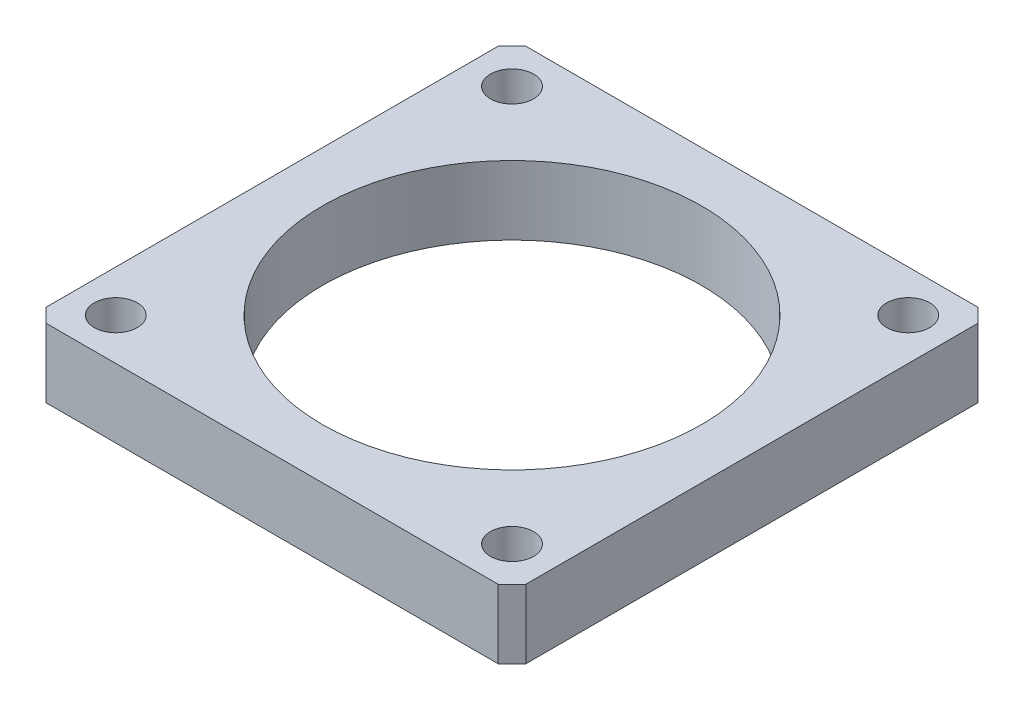
ISO-10303-21;
HEADER;
FILE_DESCRIPTION(('STEP AP214'),'2;1');
FILE_NAME('part.step','',(''),(''),'','','');
FILE_SCHEMA(('AUTOMOTIVE_DESIGN { 1 0 10303 214 1 1 1 1 }'));
ENDSEC;
DATA;
#1=APPLICATION_CONTEXT('core data for automotive mechanical design processes');
#2=APPLICATION_PROTOCOL_DEFINITION('international standard','automotive_design',2000,#1);
#3=PRODUCT_CONTEXT('',#1,'mechanical');
#4=PRODUCT('Part','Part','',(#3));
#5=PRODUCT_RELATED_PRODUCT_CATEGORY('part','',(#4));
#6=PRODUCT_DEFINITION_FORMATION('','',#4);
#7=PRODUCT_DEFINITION_CONTEXT('part definition',#1,'design');
#8=PRODUCT_DEFINITION('design','',#6,#7);
#9=PRODUCT_DEFINITION_SHAPE('','',#8);
#10=(LENGTH_UNIT() NAMED_UNIT(*) SI_UNIT(.MILLI.,.METRE.));
#11=(NAMED_UNIT(*) PLANE_ANGLE_UNIT() SI_UNIT($,.RADIAN.));
#12=(NAMED_UNIT(*) SI_UNIT($,.STERADIAN.) SOLID_ANGLE_UNIT());
#13=UNCERTAINTY_MEASURE_WITH_UNIT(LENGTH_MEASURE(1.E-05),#10,'distance_accuracy_value','');
#14=(GEOMETRIC_REPRESENTATION_CONTEXT(3) GLOBAL_UNCERTAINTY_ASSIGNED_CONTEXT((#13)) GLOBAL_UNIT_ASSIGNED_CONTEXT((#10,
#11,#12)) REPRESENTATION_CONTEXT('',''));
#15=CARTESIAN_POINT('',(0.,0.,0.));
#16=DIRECTION('',(0.,0.,1.));
#17=DIRECTION('',(1.,0.,0.));
#18=AXIS2_PLACEMENT_3D('',#15,#16,#17);
#19=CARTESIAN_POINT('',(0.,4.,0.));
#20=DIRECTION('',(0.,1.,0.));
#21=DIRECTION('',(0.,0.,1.));
#22=AXIS2_PLACEMENT_3D('',#19,#20,#21);
#23=PLANE('',#22);
#24=CARTESIAN_POINT('',(11.5,4.,-11.5));
#25=DIRECTION('',(0.,1.,0.));
#26=DIRECTION('',(0.,0.,1.));
#27=AXIS2_PLACEMENT_3D('',#24,#25,#26);
#28=CIRCLE('',#27,1.25);
#29=CARTESIAN_POINT('',(11.5,4.,-10.25));
#30=VERTEX_POINT('',#29);
#31=EDGE_CURVE('E194',#30,#30,#28,.T.);
#32=ORIENTED_EDGE('',*,*,#31,.F.);
#33=EDGE_LOOP('',(#32));
#34=FACE_BOUND('',#33,.T.);
#35=CARTESIAN_POINT('',(-11.5,4.,11.5));
#36=DIRECTION('',(0.,1.,0.));
#37=DIRECTION('',(0.,0.,1.));
#38=AXIS2_PLACEMENT_3D('',#35,#36,#37);
#39=CIRCLE('',#38,1.25);
#40=CARTESIAN_POINT('',(-11.5,4.,12.75));
#41=VERTEX_POINT('',#40);
#42=EDGE_CURVE('E183',#41,#41,#39,.T.);
#43=ORIENTED_EDGE('',*,*,#42,.F.);
#44=EDGE_LOOP('',(#43));
#45=FACE_BOUND('',#44,.T.);
#46=DIRECTION('',(0.,0.,-1.));
#47=VECTOR('',#46,1.);
#48=CARTESIAN_POINT('',(13.925,4.,13.925));
#49=LINE('',#48,#47);
#50=CARTESIAN_POINT('',(13.925,4.,13.125));
#51=VERTEX_POINT('',#50);
#52=CARTESIAN_POINT('',(13.925,4.,-13.125));
#53=VERTEX_POINT('',#52);
#54=EDGE_CURVE('E138',#51,#53,#49,.T.);
#55=ORIENTED_EDGE('',*,*,#54,.T.);
#56=DIRECTION('',(0.707106781186544,0.,0.707106781186551));
#57=VECTOR('',#56,1.);
#58=CARTESIAN_POINT('',(13.5250000000001,4.,-13.5249999999999));
#59=LINE('',#58,#57);
#60=CARTESIAN_POINT('',(13.125,4.,-13.925));
#61=VERTEX_POINT('',#60);
#62=EDGE_CURVE('E157',#53,#61,#59,.F.);
#63=ORIENTED_EDGE('',*,*,#62,.T.);
#64=DIRECTION('',(-1.,0.,0.));
#65=VECTOR('',#64,1.);
#66=CARTESIAN_POINT('',(-13.925,4.,-13.925));
#67=LINE('',#66,#65);
#68=CARTESIAN_POINT('',(-13.125,4.,-13.925));
#69=VERTEX_POINT('',#68);
#70=EDGE_CURVE('E121',#61,#69,#67,.T.);
#71=ORIENTED_EDGE('',*,*,#70,.T.);
#72=DIRECTION('',(0.707106781186551,0.,-0.707106781186544));
#73=VECTOR('',#72,1.);
#74=CARTESIAN_POINT('',(-13.5249999999999,4.,-13.5250000000001));
#75=LINE('',#74,#73);
#76=CARTESIAN_POINT('',(-13.925,4.,-13.125));
#77=VERTEX_POINT('',#76);
#78=EDGE_CURVE('E152',#69,#77,#75,.F.);
#79=ORIENTED_EDGE('',*,*,#78,.T.);
#80=DIRECTION('',(0.,0.,1.));
#81=VECTOR('',#80,1.);
#82=CARTESIAN_POINT('',(-13.925,4.,13.925));
#83=LINE('',#82,#81);
#84=CARTESIAN_POINT('',(-13.925,4.,13.125));
#85=VERTEX_POINT('',#84);
#86=EDGE_CURVE('E168',#77,#85,#83,.T.);
#87=ORIENTED_EDGE('',*,*,#86,.T.);
#88=DIRECTION('',(-0.707106781186544,0.,-0.707106781186551));
#89=VECTOR('',#88,1.);
#90=CARTESIAN_POINT('',(-13.5250000000001,4.,13.5249999999999));
#91=LINE('',#90,#89);
#92=CARTESIAN_POINT('',(-13.125,4.,13.925));
#93=VERTEX_POINT('',#92);
#94=EDGE_CURVE('E57',#85,#93,#91,.F.);
#95=ORIENTED_EDGE('',*,*,#94,.T.);
#96=DIRECTION('',(1.,0.,0.));
#97=VECTOR('',#96,1.);
#98=CARTESIAN_POINT('',(-13.925,4.,13.925));
#99=LINE('',#98,#97);
#100=CARTESIAN_POINT('',(13.125,4.,13.925));
#101=VERTEX_POINT('',#100);
#102=EDGE_CURVE('E176',#93,#101,#99,.T.);
#103=ORIENTED_EDGE('',*,*,#102,.T.);
#104=DIRECTION('',(-0.707106781186551,0.,0.707106781186544));
#105=VECTOR('',#104,1.);
#106=CARTESIAN_POINT('',(13.5249999999999,4.,13.5250000000001));
#107=LINE('',#106,#105);
#108=EDGE_CURVE('E155',#101,#51,#107,.F.);
#109=ORIENTED_EDGE('',*,*,#108,.T.);
#110=EDGE_LOOP('',(#55,#63,#71,#79,#87,#95,#103,#109));
#111=FACE_BOUND('',#110,.T.);
#112=CARTESIAN_POINT('',(-11.5,4.,-11.5));
#113=DIRECTION('',(0.,1.,0.));
#114=DIRECTION('',(0.,0.,1.));
#115=AXIS2_PLACEMENT_3D('',#112,#113,#114);
#116=CIRCLE('',#115,1.25);
#117=CARTESIAN_POINT('',(-11.5,4.,-10.25));
#118=VERTEX_POINT('',#117);
#119=EDGE_CURVE('E129',#118,#118,#116,.T.);
#120=ORIENTED_EDGE('',*,*,#119,.F.);
#121=EDGE_LOOP('',(#120));
#122=FACE_BOUND('',#121,.T.);
#123=CARTESIAN_POINT('',(11.5,4.,11.5));
#124=DIRECTION('',(0.,1.,0.));
#125=DIRECTION('',(0.,0.,1.));
#126=AXIS2_PLACEMENT_3D('',#123,#124,#125);
#127=CIRCLE('',#126,1.25);
#128=CARTESIAN_POINT('',(11.5,4.,12.75));
#129=VERTEX_POINT('',#128);
#130=EDGE_CURVE('E188',#129,#129,#127,.T.);
#131=ORIENTED_EDGE('',*,*,#130,.F.);
#132=EDGE_LOOP('',(#131));
#133=FACE_BOUND('',#132,.T.);
#134=CARTESIAN_POINT('',(0.,4.,0.));
#135=DIRECTION('',(0.,1.,0.));
#136=DIRECTION('',(0.,0.,1.));
#137=AXIS2_PLACEMENT_3D('',#134,#135,#136);
#138=CIRCLE('',#137,11.);
#139=CARTESIAN_POINT('',(0.,4.,11.));
#140=VERTEX_POINT('',#139);
#141=EDGE_CURVE('E200',#140,#140,#138,.T.);
#142=ORIENTED_EDGE('',*,*,#141,.F.);
#143=EDGE_LOOP('',(#142));
#144=FACE_BOUND('',#143,.T.);
#145=ADVANCED_FACE('F35',(#34,#45,#111,#122,#133,#144),#23,.T.);
#146=CARTESIAN_POINT('',(0.,0.,0.));
#147=DIRECTION('',(0.,1.,0.));
#148=DIRECTION('',(0.,0.,1.));
#149=AXIS2_PLACEMENT_3D('',#146,#147,#148);
#150=PLANE('',#149);
#151=CARTESIAN_POINT('',(11.5,0.,-11.5));
#152=DIRECTION('',(0.,1.,0.));
#153=DIRECTION('',(0.,0.,1.));
#154=AXIS2_PLACEMENT_3D('',#151,#152,#153);
#155=CIRCLE('',#154,1.25);
#156=CARTESIAN_POINT('',(11.5,0.,-10.25));
#157=VERTEX_POINT('',#156);
#158=EDGE_CURVE('E197',#157,#157,#155,.T.);
#159=ORIENTED_EDGE('',*,*,#158,.T.);
#160=EDGE_LOOP('',(#159));
#161=FACE_BOUND('',#160,.T.);
#162=CARTESIAN_POINT('',(-11.5,0.,11.5));
#163=DIRECTION('',(0.,1.,0.));
#164=DIRECTION('',(0.,0.,1.));
#165=AXIS2_PLACEMENT_3D('',#162,#163,#164);
#166=CIRCLE('',#165,1.25);
#167=CARTESIAN_POINT('',(-11.5,0.,12.75));
#168=VERTEX_POINT('',#167);
#169=EDGE_CURVE('E185',#168,#168,#166,.T.);
#170=ORIENTED_EDGE('',*,*,#169,.T.);
#171=EDGE_LOOP('',(#170));
#172=FACE_BOUND('',#171,.T.);
#173=DIRECTION('',(-1.,0.,0.));
#174=VECTOR('',#173,1.);
#175=CARTESIAN_POINT('',(-13.925,0.,-13.925));
#176=LINE('',#175,#174);
#177=CARTESIAN_POINT('',(13.125,0.,-13.925));
#178=VERTEX_POINT('',#177);
#179=CARTESIAN_POINT('',(-13.125,0.,-13.925));
#180=VERTEX_POINT('',#179);
#181=EDGE_CURVE('E118',#178,#180,#176,.T.);
#182=ORIENTED_EDGE('',*,*,#181,.F.);
#183=DIRECTION('',(-0.707106781186544,0.,-0.707106781186551));
#184=VECTOR('',#183,1.);
#185=CARTESIAN_POINT('',(13.125,0.,-13.925));
#186=LINE('',#185,#184);
#187=CARTESIAN_POINT('',(13.925,0.,-13.125));
#188=VERTEX_POINT('',#187);
#189=EDGE_CURVE('E101',#178,#188,#186,.F.);
#190=ORIENTED_EDGE('',*,*,#189,.T.);
#191=DIRECTION('',(0.,0.,-1.));
#192=VECTOR('',#191,1.);
#193=CARTESIAN_POINT('',(13.925,0.,13.925));
#194=LINE('',#193,#192);
#195=CARTESIAN_POINT('',(13.925,0.,13.125));
#196=VERTEX_POINT('',#195);
#197=EDGE_CURVE('E142',#196,#188,#194,.T.);
#198=ORIENTED_EDGE('',*,*,#197,.F.);
#199=DIRECTION('',(0.707106781186551,0.,-0.707106781186544));
#200=VECTOR('',#199,1.);
#201=CARTESIAN_POINT('',(13.925,0.,13.125));
#202=LINE('',#201,#200);
#203=CARTESIAN_POINT('',(13.125,0.,13.925));
#204=VERTEX_POINT('',#203);
#205=EDGE_CURVE('E112',#196,#204,#202,.F.);
#206=ORIENTED_EDGE('',*,*,#205,.T.);
#207=DIRECTION('',(1.,0.,0.));
#208=VECTOR('',#207,1.);
#209=CARTESIAN_POINT('',(-13.925,0.,13.925));
#210=LINE('',#209,#208);
#211=CARTESIAN_POINT('',(-13.125,0.,13.925));
#212=VERTEX_POINT('',#211);
#213=EDGE_CURVE('E132',#212,#204,#210,.T.);
#214=ORIENTED_EDGE('',*,*,#213,.F.);
#215=DIRECTION('',(0.707106781186544,0.,0.707106781186551));
#216=VECTOR('',#215,1.);
#217=CARTESIAN_POINT('',(-13.125,0.,13.925));
#218=LINE('',#217,#216);
#219=CARTESIAN_POINT('',(-13.925,0.,13.125));
#220=VERTEX_POINT('',#219);
#221=EDGE_CURVE('E146',#212,#220,#218,.F.);
#222=ORIENTED_EDGE('',*,*,#221,.T.);
#223=DIRECTION('',(0.,0.,1.));
#224=VECTOR('',#223,1.);
#225=CARTESIAN_POINT('',(-13.925,0.,13.925));
#226=LINE('',#225,#224);
#227=CARTESIAN_POINT('',(-13.925,0.,-13.125));
#228=VERTEX_POINT('',#227);
#229=EDGE_CURVE('E128',#228,#220,#226,.T.);
#230=ORIENTED_EDGE('',*,*,#229,.F.);
#231=DIRECTION('',(-0.707106781186551,0.,0.707106781186544));
#232=VECTOR('',#231,1.);
#233=CARTESIAN_POINT('',(-13.925,0.,-13.125));
#234=LINE('',#233,#232);
#235=EDGE_CURVE('E122',#228,#180,#234,.F.);
#236=ORIENTED_EDGE('',*,*,#235,.T.);
#237=EDGE_LOOP('',(#182,#190,#198,#206,#214,#222,#230,#236));
#238=FACE_BOUND('',#237,.T.);
#239=CARTESIAN_POINT('',(-11.5,0.,-11.5));
#240=DIRECTION('',(0.,1.,0.));
#241=DIRECTION('',(0.,0.,1.));
#242=AXIS2_PLACEMENT_3D('',#239,#240,#241);
#243=CIRCLE('',#242,1.25);
#244=CARTESIAN_POINT('',(-11.5,0.,-10.25));
#245=VERTEX_POINT('',#244);
#246=EDGE_CURVE('E135',#245,#245,#243,.T.);
#247=ORIENTED_EDGE('',*,*,#246,.T.);
#248=EDGE_LOOP('',(#247));
#249=FACE_BOUND('',#248,.T.);
#250=CARTESIAN_POINT('',(11.5,0.,11.5));
#251=DIRECTION('',(0.,1.,0.));
#252=DIRECTION('',(0.,0.,1.));
#253=AXIS2_PLACEMENT_3D('',#250,#251,#252);
#254=CIRCLE('',#253,1.25);
#255=CARTESIAN_POINT('',(11.5,0.,12.75));
#256=VERTEX_POINT('',#255);
#257=EDGE_CURVE('E191',#256,#256,#254,.T.);
#258=ORIENTED_EDGE('',*,*,#257,.T.);
#259=EDGE_LOOP('',(#258));
#260=FACE_BOUND('',#259,.T.);
#261=CARTESIAN_POINT('',(0.,0.,0.));
#262=DIRECTION('',(0.,1.,0.));
#263=DIRECTION('',(0.,0.,1.));
#264=AXIS2_PLACEMENT_3D('',#261,#262,#263);
#265=CIRCLE('',#264,11.);
#266=CARTESIAN_POINT('',(0.,0.,11.));
#267=VERTEX_POINT('',#266);
#268=EDGE_CURVE('E203',#267,#267,#265,.T.);
#269=ORIENTED_EDGE('',*,*,#268,.T.);
#270=EDGE_LOOP('',(#269));
#271=FACE_BOUND('',#270,.T.);
#272=ADVANCED_FACE('F125',(#161,#172,#238,#249,#260,#271),#150,.F.);
#273=CARTESIAN_POINT('',(-13.925,4.,-13.925));
#274=DIRECTION('',(0.,0.,1.));
#275=DIRECTION('',(1.,0.,0.));
#276=AXIS2_PLACEMENT_3D('',#273,#274,#275);
#277=PLANE('',#276);
#278=ORIENTED_EDGE('',*,*,#70,.F.);
#279=DIRECTION('',(0.,-1.,0.));
#280=VECTOR('',#279,1.);
#281=CARTESIAN_POINT('',(13.125,4.,-13.925));
#282=LINE('',#281,#280);
#283=EDGE_CURVE('E105',#61,#178,#282,.T.);
#284=ORIENTED_EDGE('',*,*,#283,.T.);
#285=ORIENTED_EDGE('',*,*,#181,.T.);
#286=DIRECTION('',(0.,1.,0.));
#287=VECTOR('',#286,1.);
#288=CARTESIAN_POINT('',(-13.125,4.,-13.925));
#289=LINE('',#288,#287);
#290=EDGE_CURVE('E123',#180,#69,#289,.T.);
#291=ORIENTED_EDGE('',*,*,#290,.T.);
#292=EDGE_LOOP('',(#278,#284,#285,#291));
#293=FACE_BOUND('',#292,.T.);
#294=ADVANCED_FACE('F117',(#293),#277,.F.);
#295=CARTESIAN_POINT('',(-13.925,4.,13.925));
#296=DIRECTION('',(1.,0.,0.));
#297=DIRECTION('',(0.,0.,-1.));
#298=AXIS2_PLACEMENT_3D('',#295,#296,#297);
#299=PLANE('',#298);
#300=ORIENTED_EDGE('',*,*,#229,.T.);
#301=DIRECTION('',(0.,1.,0.));
#302=VECTOR('',#301,1.);
#303=CARTESIAN_POINT('',(-13.925,4.,13.125));
#304=LINE('',#303,#302);
#305=EDGE_CURVE('E11',#220,#85,#304,.T.);
#306=ORIENTED_EDGE('',*,*,#305,.T.);
#307=ORIENTED_EDGE('',*,*,#86,.F.);
#308=DIRECTION('',(0.,-1.,0.));
#309=VECTOR('',#308,1.);
#310=CARTESIAN_POINT('',(-13.925,4.,-13.125));
#311=LINE('',#310,#309);
#312=EDGE_CURVE('E43',#77,#228,#311,.T.);
#313=ORIENTED_EDGE('',*,*,#312,.T.);
#314=EDGE_LOOP('',(#300,#306,#307,#313));
#315=FACE_BOUND('',#314,.T.);
#316=ADVANCED_FACE('F166',(#315),#299,.F.);
#317=CARTESIAN_POINT('',(-13.925,4.,13.925));
#318=DIRECTION('',(0.,0.,-1.));
#319=DIRECTION('',(-1.,0.,0.));
#320=AXIS2_PLACEMENT_3D('',#317,#318,#319);
#321=PLANE('',#320);
#322=ORIENTED_EDGE('',*,*,#213,.T.);
#323=DIRECTION('',(0.,1.,0.));
#324=VECTOR('',#323,1.);
#325=CARTESIAN_POINT('',(13.125,4.,13.925));
#326=LINE('',#325,#324);
#327=EDGE_CURVE('E50',#204,#101,#326,.T.);
#328=ORIENTED_EDGE('',*,*,#327,.T.);
#329=ORIENTED_EDGE('',*,*,#102,.F.);
#330=DIRECTION('',(0.,-1.,0.));
#331=VECTOR('',#330,1.);
#332=CARTESIAN_POINT('',(-13.125,4.,13.925));
#333=LINE('',#332,#331);
#334=EDGE_CURVE('E159',#93,#212,#333,.T.);
#335=ORIENTED_EDGE('',*,*,#334,.T.);
#336=EDGE_LOOP('',(#322,#328,#329,#335));
#337=FACE_BOUND('',#336,.T.);
#338=ADVANCED_FACE('F175',(#337),#321,.F.);
#339=CARTESIAN_POINT('',(13.925,4.,13.925));
#340=DIRECTION('',(-1.,0.,0.));
#341=DIRECTION('',(0.,0.,1.));
#342=AXIS2_PLACEMENT_3D('',#339,#340,#341);
#343=PLANE('',#342);
#344=ORIENTED_EDGE('',*,*,#197,.T.);
#345=DIRECTION('',(0.,1.,0.));
#346=VECTOR('',#345,1.);
#347=CARTESIAN_POINT('',(13.925,4.,-13.125));
#348=LINE('',#347,#346);
#349=EDGE_CURVE('E106',#188,#53,#348,.T.);
#350=ORIENTED_EDGE('',*,*,#349,.T.);
#351=ORIENTED_EDGE('',*,*,#54,.F.);
#352=DIRECTION('',(0.,-1.,0.));
#353=VECTOR('',#352,1.);
#354=CARTESIAN_POINT('',(13.925,4.,13.125));
#355=LINE('',#354,#353);
#356=EDGE_CURVE('E111',#51,#196,#355,.T.);
#357=ORIENTED_EDGE('',*,*,#356,.T.);
#358=EDGE_LOOP('',(#344,#350,#351,#357));
#359=FACE_BOUND('',#358,.T.);
#360=ADVANCED_FACE('F226',(#359),#343,.F.);
#361=CARTESIAN_POINT('',(-11.5,4.,-11.5));
#362=DIRECTION('',(0.,-1.,0.));
#363=DIRECTION('',(0.,0.,-1.));
#364=AXIS2_PLACEMENT_3D('',#361,#362,#363);
#365=CYLINDRICAL_SURFACE('',#364,1.25);
#366=ORIENTED_EDGE('',*,*,#119,.T.);
#367=EDGE_LOOP('',(#366));
#368=FACE_BOUND('',#367,.T.);
#369=ORIENTED_EDGE('',*,*,#246,.F.);
#370=EDGE_LOOP('',(#369));
#371=FACE_BOUND('',#370,.T.);
#372=ADVANCED_FACE('F223',(#368,#371),#365,.F.);
#373=CARTESIAN_POINT('',(-11.5,4.,11.5));
#374=DIRECTION('',(0.,-1.,0.));
#375=DIRECTION('',(0.,0.,-1.));
#376=AXIS2_PLACEMENT_3D('',#373,#374,#375);
#377=CYLINDRICAL_SURFACE('',#376,1.25);
#378=ORIENTED_EDGE('',*,*,#42,.T.);
#379=EDGE_LOOP('',(#378));
#380=FACE_BOUND('',#379,.T.);
#381=ORIENTED_EDGE('',*,*,#169,.F.);
#382=EDGE_LOOP('',(#381));
#383=FACE_BOUND('',#382,.T.);
#384=ADVANCED_FACE('F258',(#380,#383),#377,.F.);
#385=CARTESIAN_POINT('',(11.5,4.,11.5));
#386=DIRECTION('',(0.,-1.,0.));
#387=DIRECTION('',(0.,0.,-1.));
#388=AXIS2_PLACEMENT_3D('',#385,#386,#387);
#389=CYLINDRICAL_SURFACE('',#388,1.25);
#390=ORIENTED_EDGE('',*,*,#130,.T.);
#391=EDGE_LOOP('',(#390));
#392=FACE_BOUND('',#391,.T.);
#393=ORIENTED_EDGE('',*,*,#257,.F.);
#394=EDGE_LOOP('',(#393));
#395=FACE_BOUND('',#394,.T.);
#396=ADVANCED_FACE('F254',(#392,#395),#389,.F.);
#397=CARTESIAN_POINT('',(11.5,4.,-11.5));
#398=DIRECTION('',(0.,-1.,0.));
#399=DIRECTION('',(0.,0.,-1.));
#400=AXIS2_PLACEMENT_3D('',#397,#398,#399);
#401=CYLINDRICAL_SURFACE('',#400,1.25);
#402=ORIENTED_EDGE('',*,*,#31,.T.);
#403=EDGE_LOOP('',(#402));
#404=FACE_BOUND('',#403,.T.);
#405=ORIENTED_EDGE('',*,*,#158,.F.);
#406=EDGE_LOOP('',(#405));
#407=FACE_BOUND('',#406,.T.);
#408=ADVANCED_FACE('F257',(#404,#407),#401,.F.);
#409=CARTESIAN_POINT('',(0.,4.,0.));
#410=DIRECTION('',(0.,-1.,0.));
#411=DIRECTION('',(0.,0.,-1.));
#412=AXIS2_PLACEMENT_3D('',#409,#410,#411);
#413=CYLINDRICAL_SURFACE('',#412,11.);
#414=ORIENTED_EDGE('',*,*,#141,.T.);
#415=EDGE_LOOP('',(#414));
#416=FACE_BOUND('',#415,.T.);
#417=ORIENTED_EDGE('',*,*,#268,.F.);
#418=EDGE_LOOP('',(#417));
#419=FACE_BOUND('',#418,.T.);
#420=ADVANCED_FACE('F209',(#416,#419),#413,.F.);
#421=CARTESIAN_POINT('',(13.125,4.,-13.925));
#422=DIRECTION('',(-0.707106781186551,0.,0.707106781186544));
#423=DIRECTION('',(0.,-1.,0.));
#424=AXIS2_PLACEMENT_3D('',#421,#422,#423);
#425=PLANE('',#424);
#426=ORIENTED_EDGE('',*,*,#62,.F.);
#427=ORIENTED_EDGE('',*,*,#349,.F.);
#428=ORIENTED_EDGE('',*,*,#189,.F.);
#429=ORIENTED_EDGE('',*,*,#283,.F.);
#430=EDGE_LOOP('',(#426,#427,#428,#429));
#431=FACE_BOUND('',#430,.T.);
#432=ADVANCED_FACE('F104',(#431),#425,.F.);
#433=CARTESIAN_POINT('',(13.925,4.,13.125));
#434=DIRECTION('',(-0.707106781186544,0.,-0.707106781186551));
#435=DIRECTION('',(0.,-1.,0.));
#436=AXIS2_PLACEMENT_3D('',#433,#434,#435);
#437=PLANE('',#436);
#438=ORIENTED_EDGE('',*,*,#108,.F.);
#439=ORIENTED_EDGE('',*,*,#327,.F.);
#440=ORIENTED_EDGE('',*,*,#205,.F.);
#441=ORIENTED_EDGE('',*,*,#356,.F.);
#442=EDGE_LOOP('',(#438,#439,#440,#441));
#443=FACE_BOUND('',#442,.T.);
#444=ADVANCED_FACE('F238',(#443),#437,.F.);
#445=CARTESIAN_POINT('',(-13.125,4.,13.925));
#446=DIRECTION('',(0.707106781186551,0.,-0.707106781186544));
#447=DIRECTION('',(0.,-1.,0.));
#448=AXIS2_PLACEMENT_3D('',#445,#446,#447);
#449=PLANE('',#448);
#450=ORIENTED_EDGE('',*,*,#94,.F.);
#451=ORIENTED_EDGE('',*,*,#305,.F.);
#452=ORIENTED_EDGE('',*,*,#221,.F.);
#453=ORIENTED_EDGE('',*,*,#334,.F.);
#454=EDGE_LOOP('',(#450,#451,#452,#453));
#455=FACE_BOUND('',#454,.T.);
#456=ADVANCED_FACE('F174',(#455),#449,.F.);
#457=CARTESIAN_POINT('',(-13.925,4.,-13.125));
#458=DIRECTION('',(0.707106781186544,0.,0.707106781186551));
#459=DIRECTION('',(0.,-1.,0.));
#460=AXIS2_PLACEMENT_3D('',#457,#458,#459);
#461=PLANE('',#460);
#462=ORIENTED_EDGE('',*,*,#78,.F.);
#463=ORIENTED_EDGE('',*,*,#290,.F.);
#464=ORIENTED_EDGE('',*,*,#235,.F.);
#465=ORIENTED_EDGE('',*,*,#312,.F.);
#466=EDGE_LOOP('',(#462,#463,#464,#465));
#467=FACE_BOUND('',#466,.T.);
#468=ADVANCED_FACE('F37',(#467),#461,.F.);
#469=CLOSED_SHELL('',(#145,#272,#294,#316,#338,#360,#372,#384,#396,#408,#420,#432,#444,#456,#468));
#470=MANIFOLD_SOLID_BREP('B2',#469);
#471=ADVANCED_BREP_SHAPE_REPRESENTATION('',(#18,#470),#14);
#472=SHAPE_DEFINITION_REPRESENTATION(#9,#471);
ENDSEC;
END-ISO-10303-21;
